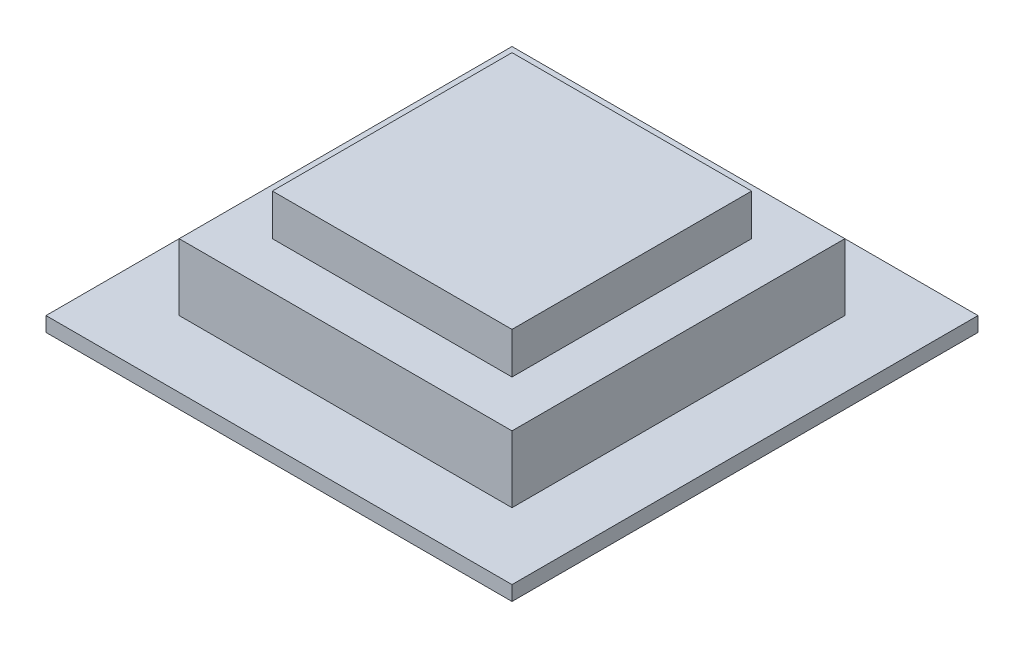
ISO-10303-21;
HEADER;
FILE_DESCRIPTION(('STEP AP214'),'2;1');
FILE_NAME('part.step','',(''),(''),'','','');
FILE_SCHEMA(('AUTOMOTIVE_DESIGN { 1 0 10303 214 1 1 1 1 }'));
ENDSEC;
DATA;
#1=APPLICATION_CONTEXT('core data for automotive mechanical design processes');
#2=APPLICATION_PROTOCOL_DEFINITION('international standard','automotive_design',2000,#1);
#3=PRODUCT_CONTEXT('',#1,'mechanical');
#4=PRODUCT('Part','Part','',(#3));
#5=PRODUCT_RELATED_PRODUCT_CATEGORY('part','',(#4));
#6=PRODUCT_DEFINITION_FORMATION('','',#4);
#7=PRODUCT_DEFINITION_CONTEXT('part definition',#1,'design');
#8=PRODUCT_DEFINITION('design','',#6,#7);
#9=PRODUCT_DEFINITION_SHAPE('','',#8);
#10=(LENGTH_UNIT() NAMED_UNIT(*) SI_UNIT(.MILLI.,.METRE.));
#11=(NAMED_UNIT(*) PLANE_ANGLE_UNIT() SI_UNIT($,.RADIAN.));
#12=(NAMED_UNIT(*) SI_UNIT($,.STERADIAN.) SOLID_ANGLE_UNIT());
#13=UNCERTAINTY_MEASURE_WITH_UNIT(LENGTH_MEASURE(1.E-05),#10,'distance_accuracy_value','');
#14=(GEOMETRIC_REPRESENTATION_CONTEXT(3) GLOBAL_UNCERTAINTY_ASSIGNED_CONTEXT((#13)) GLOBAL_UNIT_ASSIGNED_CONTEXT((#10,
#11,#12)) REPRESENTATION_CONTEXT('',''));
#15=CARTESIAN_POINT('',(0.,0.,0.));
#16=DIRECTION('',(0.,0.,1.));
#17=DIRECTION('',(1.,0.,0.));
#18=AXIS2_PLACEMENT_3D('',#15,#16,#17);
#19=CARTESIAN_POINT('',(0.,6.1,0.));
#20=DIRECTION('',(0.,-1.,0.));
#21=DIRECTION('',(0.,0.,-1.));
#22=AXIS2_PLACEMENT_3D('',#19,#20,#21);
#23=PLANE('',#22);
#24=DIRECTION('',(0.,0.,-1.));
#25=VECTOR('',#24,1.);
#26=CARTESIAN_POINT('',(12.5,6.1,12.5));
#27=LINE('',#26,#25);
#28=CARTESIAN_POINT('',(12.5,6.1,12.5));
#29=VERTEX_POINT('',#28);
#30=CARTESIAN_POINT('',(12.5,6.1,-12.5));
#31=VERTEX_POINT('',#30);
#32=EDGE_CURVE('E164',#29,#31,#27,.T.);
#33=ORIENTED_EDGE('',*,*,#32,.T.);
#34=DIRECTION('',(-1.,0.,0.));
#35=VECTOR('',#34,1.);
#36=CARTESIAN_POINT('',(-12.5,6.1,-12.5));
#37=LINE('',#36,#35);
#38=CARTESIAN_POINT('',(-12.5,6.1,-12.5));
#39=VERTEX_POINT('',#38);
#40=EDGE_CURVE('E168',#31,#39,#37,.T.);
#41=ORIENTED_EDGE('',*,*,#40,.T.);
#42=DIRECTION('',(0.,0.,1.));
#43=VECTOR('',#42,1.);
#44=CARTESIAN_POINT('',(-12.5,6.1,12.5));
#45=LINE('',#44,#43);
#46=CARTESIAN_POINT('',(-12.5,6.1,12.5));
#47=VERTEX_POINT('',#46);
#48=EDGE_CURVE('E172',#39,#47,#45,.T.);
#49=ORIENTED_EDGE('',*,*,#48,.T.);
#50=DIRECTION('',(1.,0.,0.));
#51=VECTOR('',#50,1.);
#52=CARTESIAN_POINT('',(-12.5,6.1,12.5));
#53=LINE('',#52,#51);
#54=EDGE_CURVE('E175',#47,#29,#53,.T.);
#55=ORIENTED_EDGE('',*,*,#54,.T.);
#56=EDGE_LOOP('',(#33,#41,#49,#55));
#57=FACE_BOUND('',#56,.T.);
#58=DIRECTION('',(1.,0.,0.));
#59=VECTOR('',#58,1.);
#60=CARTESIAN_POINT('',(0.,6.1,9.));
#61=LINE('',#60,#59);
#62=CARTESIAN_POINT('',(-9.,6.1,9.));
#63=VERTEX_POINT('',#62);
#64=CARTESIAN_POINT('',(9.,6.1,9.));
#65=VERTEX_POINT('',#64);
#66=EDGE_CURVE('E55',#63,#65,#61,.T.);
#67=ORIENTED_EDGE('',*,*,#66,.F.);
#68=DIRECTION('',(0.,0.,-1.));
#69=VECTOR('',#68,1.);
#70=CARTESIAN_POINT('',(-9.,6.1,0.));
#71=LINE('',#70,#69);
#72=CARTESIAN_POINT('',(-9.,6.1,-9.));
#73=VERTEX_POINT('',#72);
#74=EDGE_CURVE('E60',#63,#73,#71,.T.);
#75=ORIENTED_EDGE('',*,*,#74,.T.);
#76=DIRECTION('',(1.,0.,0.));
#77=VECTOR('',#76,1.);
#78=CARTESIAN_POINT('',(0.,6.1,-9.));
#79=LINE('',#78,#77);
#80=CARTESIAN_POINT('',(9.,6.1,-9.));
#81=VERTEX_POINT('',#80);
#82=EDGE_CURVE('E403',#73,#81,#79,.T.);
#83=ORIENTED_EDGE('',*,*,#82,.T.);
#84=DIRECTION('',(0.,0.,-1.));
#85=VECTOR('',#84,1.);
#86=CARTESIAN_POINT('',(9.,6.1,0.));
#87=LINE('',#86,#85);
#88=EDGE_CURVE('E406',#65,#81,#87,.T.);
#89=ORIENTED_EDGE('',*,*,#88,.F.);
#90=EDGE_LOOP('',(#67,#75,#83,#89));
#91=FACE_BOUND('',#90,.T.);
#92=ADVANCED_FACE('F39',(#57,#91),#23,.F.);
#93=CARTESIAN_POINT('',(0.,1.1,0.));
#94=DIRECTION('',(0.,-1.,0.));
#95=DIRECTION('',(0.,0.,-1.));
#96=AXIS2_PLACEMENT_3D('',#93,#94,#95);
#97=PLANE('',#96);
#98=DIRECTION('',(0.,0.,-1.));
#99=VECTOR('',#98,1.);
#100=CARTESIAN_POINT('',(17.5,1.1,17.4999999999999));
#101=LINE('',#100,#99);
#102=CARTESIAN_POINT('',(17.5,1.1,17.4999999999999));
#103=VERTEX_POINT('',#102);
#104=CARTESIAN_POINT('',(17.5,1.1,-17.5));
#105=VERTEX_POINT('',#104);
#106=EDGE_CURVE('E205',#103,#105,#101,.T.);
#107=ORIENTED_EDGE('',*,*,#106,.T.);
#108=DIRECTION('',(-1.,0.,0.));
#109=VECTOR('',#108,1.);
#110=CARTESIAN_POINT('',(-17.4999999999999,1.1,-17.5));
#111=LINE('',#110,#109);
#112=CARTESIAN_POINT('',(-17.4999999999999,1.1,-17.5));
#113=VERTEX_POINT('',#112);
#114=EDGE_CURVE('E209',#105,#113,#111,.T.);
#115=ORIENTED_EDGE('',*,*,#114,.T.);
#116=DIRECTION('',(0.,0.,1.));
#117=VECTOR('',#116,1.);
#118=CARTESIAN_POINT('',(-17.4999999999999,1.1,17.4999999999999));
#119=LINE('',#118,#117);
#120=CARTESIAN_POINT('',(-17.4999999999999,1.1,17.4999999999999));
#121=VERTEX_POINT('',#120);
#122=EDGE_CURVE('E213',#113,#121,#119,.T.);
#123=ORIENTED_EDGE('',*,*,#122,.T.);
#124=DIRECTION('',(1.,0.,0.));
#125=VECTOR('',#124,1.);
#126=CARTESIAN_POINT('',(-17.4999999999999,1.1,17.4999999999999));
#127=LINE('',#126,#125);
#128=EDGE_CURVE('E216',#121,#103,#127,.T.);
#129=ORIENTED_EDGE('',*,*,#128,.T.);
#130=EDGE_LOOP('',(#107,#115,#123,#129));
#131=FACE_BOUND('',#130,.T.);
#132=DIRECTION('',(0.,0.,-1.));
#133=VECTOR('',#132,1.);
#134=CARTESIAN_POINT('',(12.5,1.1,12.5));
#135=LINE('',#134,#133);
#136=CARTESIAN_POINT('',(12.5,1.1,12.5));
#137=VERTEX_POINT('',#136);
#138=CARTESIAN_POINT('',(12.5,1.1,-12.5));
#139=VERTEX_POINT('',#138);
#140=EDGE_CURVE('E153',#137,#139,#135,.T.);
#141=ORIENTED_EDGE('',*,*,#140,.F.);
#142=DIRECTION('',(1.,0.,0.));
#143=VECTOR('',#142,1.);
#144=CARTESIAN_POINT('',(-12.5,1.1,12.5));
#145=LINE('',#144,#143);
#146=CARTESIAN_POINT('',(-12.5,1.1,12.5));
#147=VERTEX_POINT('',#146);
#148=EDGE_CURVE('E169',#147,#137,#145,.T.);
#149=ORIENTED_EDGE('',*,*,#148,.F.);
#150=DIRECTION('',(0.,0.,1.));
#151=VECTOR('',#150,1.);
#152=CARTESIAN_POINT('',(-12.5,1.1,12.5));
#153=LINE('',#152,#151);
#154=CARTESIAN_POINT('',(-12.5,1.1,-12.5));
#155=VERTEX_POINT('',#154);
#156=EDGE_CURVE('E182',#155,#147,#153,.T.);
#157=ORIENTED_EDGE('',*,*,#156,.F.);
#158=DIRECTION('',(-1.,0.,0.));
#159=VECTOR('',#158,1.);
#160=CARTESIAN_POINT('',(-12.5,1.1,-12.5));
#161=LINE('',#160,#159);
#162=EDGE_CURVE('E158',#139,#155,#161,.T.);
#163=ORIENTED_EDGE('',*,*,#162,.F.);
#164=EDGE_LOOP('',(#141,#149,#157,#163));
#165=FACE_BOUND('',#164,.T.);
#166=ADVANCED_FACE('F258',(#131,#165),#97,.F.);
#167=CARTESIAN_POINT('',(17.5,1.1,17.4999999999999));
#168=DIRECTION('',(-1.,0.,0.));
#169=DIRECTION('',(0.,0.,1.));
#170=AXIS2_PLACEMENT_3D('',#167,#168,#169);
#171=PLANE('',#170);
#172=DIRECTION('',(0.,0.,-1.));
#173=VECTOR('',#172,1.);
#174=CARTESIAN_POINT('',(17.5,0.,17.4999999999999));
#175=LINE('',#174,#173);
#176=CARTESIAN_POINT('',(17.5,0.,17.4999999999999));
#177=VERTEX_POINT('',#176);
#178=CARTESIAN_POINT('',(17.5,0.,-17.5));
#179=VERTEX_POINT('',#178);
#180=EDGE_CURVE('E204',#177,#179,#175,.T.);
#181=ORIENTED_EDGE('',*,*,#180,.T.);
#182=DIRECTION('',(0.,-1.,0.));
#183=VECTOR('',#182,1.);
#184=CARTESIAN_POINT('',(17.5,1.1,-17.5));
#185=LINE('',#184,#183);
#186=EDGE_CURVE('E11',#105,#179,#185,.T.);
#187=ORIENTED_EDGE('',*,*,#186,.F.);
#188=ORIENTED_EDGE('',*,*,#106,.F.);
#189=DIRECTION('',(0.,-1.,0.));
#190=VECTOR('',#189,1.);
#191=CARTESIAN_POINT('',(17.5,1.1,17.4999999999999));
#192=LINE('',#191,#190);
#193=EDGE_CURVE('E219',#103,#177,#192,.T.);
#194=ORIENTED_EDGE('',*,*,#193,.T.);
#195=EDGE_LOOP('',(#181,#187,#188,#194));
#196=FACE_BOUND('',#195,.T.);
#197=ADVANCED_FACE('F41',(#196),#171,.F.);
#198=CARTESIAN_POINT('',(-17.4999999999999,1.1,-17.5));
#199=DIRECTION('',(0.,0.,1.));
#200=DIRECTION('',(1.,0.,0.));
#201=AXIS2_PLACEMENT_3D('',#198,#199,#200);
#202=PLANE('',#201);
#203=DIRECTION('',(-1.,0.,0.));
#204=VECTOR('',#203,1.);
#205=CARTESIAN_POINT('',(-17.4999999999999,0.,-17.5));
#206=LINE('',#205,#204);
#207=CARTESIAN_POINT('',(-17.4999999999999,0.,-17.5));
#208=VERTEX_POINT('',#207);
#209=EDGE_CURVE('E223',#179,#208,#206,.T.);
#210=ORIENTED_EDGE('',*,*,#209,.T.);
#211=DIRECTION('',(0.,-1.,0.));
#212=VECTOR('',#211,1.);
#213=CARTESIAN_POINT('',(-17.4999999999999,1.1,-17.5));
#214=LINE('',#213,#212);
#215=EDGE_CURVE('E48',#113,#208,#214,.T.);
#216=ORIENTED_EDGE('',*,*,#215,.F.);
#217=ORIENTED_EDGE('',*,*,#114,.F.);
#218=ORIENTED_EDGE('',*,*,#186,.T.);
#219=EDGE_LOOP('',(#210,#216,#217,#218));
#220=FACE_BOUND('',#219,.T.);
#221=ADVANCED_FACE('F260',(#220),#202,.F.);
#222=CARTESIAN_POINT('',(-17.4999999999999,1.1,17.4999999999999));
#223=DIRECTION('',(1.,0.,0.));
#224=DIRECTION('',(0.,0.,-1.));
#225=AXIS2_PLACEMENT_3D('',#222,#223,#224);
#226=PLANE('',#225);
#227=DIRECTION('',(0.,0.,1.));
#228=VECTOR('',#227,1.);
#229=CARTESIAN_POINT('',(-17.4999999999999,0.,17.4999999999999));
#230=LINE('',#229,#228);
#231=CARTESIAN_POINT('',(-17.4999999999999,0.,17.4999999999999));
#232=VERTEX_POINT('',#231);
#233=EDGE_CURVE('E226',#208,#232,#230,.T.);
#234=ORIENTED_EDGE('',*,*,#233,.T.);
#235=DIRECTION('',(0.,-1.,0.));
#236=VECTOR('',#235,1.);
#237=CARTESIAN_POINT('',(-17.4999999999999,1.1,17.4999999999999));
#238=LINE('',#237,#236);
#239=EDGE_CURVE('E234',#121,#232,#238,.T.);
#240=ORIENTED_EDGE('',*,*,#239,.F.);
#241=ORIENTED_EDGE('',*,*,#122,.F.);
#242=ORIENTED_EDGE('',*,*,#215,.T.);
#243=EDGE_LOOP('',(#234,#240,#241,#242));
#244=FACE_BOUND('',#243,.T.);
#245=ADVANCED_FACE('F243',(#244),#226,.F.);
#246=CARTESIAN_POINT('',(-17.4999999999999,1.1,17.4999999999999));
#247=DIRECTION('',(0.,0.,-1.));
#248=DIRECTION('',(-1.,0.,0.));
#249=AXIS2_PLACEMENT_3D('',#246,#247,#248);
#250=PLANE('',#249);
#251=DIRECTION('',(1.,0.,0.));
#252=VECTOR('',#251,1.);
#253=CARTESIAN_POINT('',(-17.4999999999999,0.,17.4999999999999));
#254=LINE('',#253,#252);
#255=EDGE_CURVE('E210',#232,#177,#254,.T.);
#256=ORIENTED_EDGE('',*,*,#255,.T.);
#257=ORIENTED_EDGE('',*,*,#193,.F.);
#258=ORIENTED_EDGE('',*,*,#128,.F.);
#259=ORIENTED_EDGE('',*,*,#239,.T.);
#260=EDGE_LOOP('',(#256,#257,#258,#259));
#261=FACE_BOUND('',#260,.T.);
#262=ADVANCED_FACE('F252',(#261),#250,.F.);
#263=CARTESIAN_POINT('',(0.,0.,0.));
#264=DIRECTION('',(0.,-1.,0.));
#265=DIRECTION('',(0.,0.,-1.));
#266=AXIS2_PLACEMENT_3D('',#263,#264,#265);
#267=PLANE('',#266);
#268=ORIENTED_EDGE('',*,*,#180,.F.);
#269=ORIENTED_EDGE('',*,*,#255,.F.);
#270=ORIENTED_EDGE('',*,*,#233,.F.);
#271=ORIENTED_EDGE('',*,*,#209,.F.);
#272=EDGE_LOOP('',(#268,#269,#270,#271));
#273=FACE_BOUND('',#272,.T.);
#274=ADVANCED_FACE('F249',(#273),#267,.T.);
#275=CARTESIAN_POINT('',(12.5,6.1,12.5));
#276=DIRECTION('',(-1.,0.,0.));
#277=DIRECTION('',(0.,0.,1.));
#278=AXIS2_PLACEMENT_3D('',#275,#276,#277);
#279=PLANE('',#278);
#280=ORIENTED_EDGE('',*,*,#140,.T.);
#281=DIRECTION('',(0.,-1.,0.));
#282=VECTOR('',#281,1.);
#283=CARTESIAN_POINT('',(12.5,6.1,-12.5));
#284=LINE('',#283,#282);
#285=EDGE_CURVE('E200',#31,#139,#284,.T.);
#286=ORIENTED_EDGE('',*,*,#285,.F.);
#287=ORIENTED_EDGE('',*,*,#32,.F.);
#288=DIRECTION('',(0.,-1.,0.));
#289=VECTOR('',#288,1.);
#290=CARTESIAN_POINT('',(12.5,6.1,12.5));
#291=LINE('',#290,#289);
#292=EDGE_CURVE('E177',#29,#137,#291,.T.);
#293=ORIENTED_EDGE('',*,*,#292,.T.);
#294=EDGE_LOOP('',(#280,#286,#287,#293));
#295=FACE_BOUND('',#294,.T.);
#296=ADVANCED_FACE('F288',(#295),#279,.F.);
#297=CARTESIAN_POINT('',(-12.5,6.1,-12.5));
#298=DIRECTION('',(0.,0.,1.));
#299=DIRECTION('',(1.,0.,0.));
#300=AXIS2_PLACEMENT_3D('',#297,#298,#299);
#301=PLANE('',#300);
#302=ORIENTED_EDGE('',*,*,#162,.T.);
#303=DIRECTION('',(0.,-1.,0.));
#304=VECTOR('',#303,1.);
#305=CARTESIAN_POINT('',(-12.5,6.1,-12.5));
#306=LINE('',#305,#304);
#307=EDGE_CURVE('E196',#39,#155,#306,.T.);
#308=ORIENTED_EDGE('',*,*,#307,.F.);
#309=ORIENTED_EDGE('',*,*,#40,.F.);
#310=ORIENTED_EDGE('',*,*,#285,.T.);
#311=EDGE_LOOP('',(#302,#308,#309,#310));
#312=FACE_BOUND('',#311,.T.);
#313=ADVANCED_FACE('F284',(#312),#301,.F.);
#314=CARTESIAN_POINT('',(-12.5,6.1,12.5));
#315=DIRECTION('',(1.,0.,0.));
#316=DIRECTION('',(0.,0.,-1.));
#317=AXIS2_PLACEMENT_3D('',#314,#315,#316);
#318=PLANE('',#317);
#319=ORIENTED_EDGE('',*,*,#156,.T.);
#320=DIRECTION('',(0.,-1.,0.));
#321=VECTOR('',#320,1.);
#322=CARTESIAN_POINT('',(-12.5,6.1,12.5));
#323=LINE('',#322,#321);
#324=EDGE_CURVE('E192',#47,#147,#323,.T.);
#325=ORIENTED_EDGE('',*,*,#324,.F.);
#326=ORIENTED_EDGE('',*,*,#48,.F.);
#327=ORIENTED_EDGE('',*,*,#307,.T.);
#328=EDGE_LOOP('',(#319,#325,#326,#327));
#329=FACE_BOUND('',#328,.T.);
#330=ADVANCED_FACE('F280',(#329),#318,.F.);
#331=CARTESIAN_POINT('',(-12.5,6.1,12.5));
#332=DIRECTION('',(0.,0.,-1.));
#333=DIRECTION('',(-1.,0.,0.));
#334=AXIS2_PLACEMENT_3D('',#331,#332,#333);
#335=PLANE('',#334);
#336=ORIENTED_EDGE('',*,*,#148,.T.);
#337=ORIENTED_EDGE('',*,*,#292,.F.);
#338=ORIENTED_EDGE('',*,*,#54,.F.);
#339=ORIENTED_EDGE('',*,*,#324,.T.);
#340=EDGE_LOOP('',(#336,#337,#338,#339));
#341=FACE_BOUND('',#340,.T.);
#342=ADVANCED_FACE('F277',(#341),#335,.F.);
#343=CARTESIAN_POINT('',(0.,9.2,9.));
#344=DIRECTION('',(0.,0.,-1.));
#345=DIRECTION('',(-1.,0.,0.));
#346=AXIS2_PLACEMENT_3D('',#343,#344,#345);
#347=PLANE('',#346);
#348=ORIENTED_EDGE('',*,*,#66,.T.);
#349=DIRECTION('',(0.,-1.,0.));
#350=VECTOR('',#349,1.);
#351=CARTESIAN_POINT('',(9.,9.2,9.));
#352=LINE('',#351,#350);
#353=CARTESIAN_POINT('',(9.,9.2,9.));
#354=VERTEX_POINT('',#353);
#355=EDGE_CURVE('E133',#354,#65,#352,.T.);
#356=ORIENTED_EDGE('',*,*,#355,.F.);
#357=DIRECTION('',(1.,0.,0.));
#358=VECTOR('',#357,1.);
#359=CARTESIAN_POINT('',(0.,9.2,9.));
#360=LINE('',#359,#358);
#361=CARTESIAN_POINT('',(-9.,9.2,9.));
#362=VERTEX_POINT('',#361);
#363=EDGE_CURVE('E141',#362,#354,#360,.T.);
#364=ORIENTED_EDGE('',*,*,#363,.F.);
#365=DIRECTION('',(0.,-1.,0.));
#366=VECTOR('',#365,1.);
#367=CARTESIAN_POINT('',(-9.,9.2,9.));
#368=LINE('',#367,#366);
#369=EDGE_CURVE('E400',#362,#63,#368,.T.);
#370=ORIENTED_EDGE('',*,*,#369,.T.);
#371=EDGE_LOOP('',(#348,#356,#364,#370));
#372=FACE_BOUND('',#371,.T.);
#373=ADVANCED_FACE('F151',(#372),#347,.F.);
#374=CARTESIAN_POINT('',(9.,9.2,0.));
#375=DIRECTION('',(-1.,0.,0.));
#376=DIRECTION('',(0.,0.,1.));
#377=AXIS2_PLACEMENT_3D('',#374,#375,#376);
#378=PLANE('',#377);
#379=ORIENTED_EDGE('',*,*,#88,.T.);
#380=DIRECTION('',(0.,-1.,0.));
#381=VECTOR('',#380,1.);
#382=CARTESIAN_POINT('',(9.,9.2,-9.));
#383=LINE('',#382,#381);
#384=CARTESIAN_POINT('',(9.,9.2,-9.));
#385=VERTEX_POINT('',#384);
#386=EDGE_CURVE('E135',#385,#81,#383,.T.);
#387=ORIENTED_EDGE('',*,*,#386,.F.);
#388=DIRECTION('',(0.,0.,-1.));
#389=VECTOR('',#388,1.);
#390=CARTESIAN_POINT('',(9.,9.2,0.));
#391=LINE('',#390,#389);
#392=EDGE_CURVE('E128',#354,#385,#391,.T.);
#393=ORIENTED_EDGE('',*,*,#392,.F.);
#394=ORIENTED_EDGE('',*,*,#355,.T.);
#395=EDGE_LOOP('',(#379,#387,#393,#394));
#396=FACE_BOUND('',#395,.T.);
#397=ADVANCED_FACE('F131',(#396),#378,.F.);
#398=CARTESIAN_POINT('',(0.,9.2,-9.));
#399=DIRECTION('',(0.,0.,-1.));
#400=DIRECTION('',(-1.,0.,0.));
#401=AXIS2_PLACEMENT_3D('',#398,#399,#400);
#402=PLANE('',#401);
#403=ORIENTED_EDGE('',*,*,#82,.F.);
#404=DIRECTION('',(0.,-1.,0.));
#405=VECTOR('',#404,1.);
#406=CARTESIAN_POINT('',(-9.,9.2,-9.));
#407=LINE('',#406,#405);
#408=CARTESIAN_POINT('',(-9.,9.2,-9.));
#409=VERTEX_POINT('',#408);
#410=EDGE_CURVE('E160',#409,#73,#407,.T.);
#411=ORIENTED_EDGE('',*,*,#410,.F.);
#412=DIRECTION('',(1.,0.,0.));
#413=VECTOR('',#412,1.);
#414=CARTESIAN_POINT('',(0.,9.2,-9.));
#415=LINE('',#414,#413);
#416=EDGE_CURVE('E140',#409,#385,#415,.T.);
#417=ORIENTED_EDGE('',*,*,#416,.T.);
#418=ORIENTED_EDGE('',*,*,#386,.T.);
#419=EDGE_LOOP('',(#403,#411,#417,#418));
#420=FACE_BOUND('',#419,.T.);
#421=ADVANCED_FACE('F332',(#420),#402,.T.);
#422=CARTESIAN_POINT('',(-9.,9.2,0.));
#423=DIRECTION('',(-1.,0.,0.));
#424=DIRECTION('',(0.,0.,1.));
#425=AXIS2_PLACEMENT_3D('',#422,#423,#424);
#426=PLANE('',#425);
#427=ORIENTED_EDGE('',*,*,#74,.F.);
#428=ORIENTED_EDGE('',*,*,#369,.F.);
#429=DIRECTION('',(0.,0.,-1.));
#430=VECTOR('',#429,1.);
#431=CARTESIAN_POINT('',(-9.,9.2,0.));
#432=LINE('',#431,#430);
#433=EDGE_CURVE('E147',#362,#409,#432,.T.);
#434=ORIENTED_EDGE('',*,*,#433,.T.);
#435=ORIENTED_EDGE('',*,*,#410,.T.);
#436=EDGE_LOOP('',(#427,#428,#434,#435));
#437=FACE_BOUND('',#436,.T.);
#438=ADVANCED_FACE('F338',(#437),#426,.T.);
#439=CARTESIAN_POINT('',(0.,9.2,0.));
#440=DIRECTION('',(0.,1.,0.));
#441=DIRECTION('',(0.,0.,1.));
#442=AXIS2_PLACEMENT_3D('',#439,#440,#441);
#443=PLANE('',#442);
#444=ORIENTED_EDGE('',*,*,#363,.T.);
#445=ORIENTED_EDGE('',*,*,#392,.T.);
#446=ORIENTED_EDGE('',*,*,#416,.F.);
#447=ORIENTED_EDGE('',*,*,#433,.F.);
#448=EDGE_LOOP('',(#444,#445,#446,#447));
#449=FACE_BOUND('',#448,.T.);
#450=ADVANCED_FACE('F145',(#449),#443,.T.);
#451=CLOSED_SHELL('',(#92,#166,#197,#221,#245,#262,#274,#296,#313,#330,#342,#373,#397,#421,#438,#450));
#452=MANIFOLD_SOLID_BREP('B2',#451);
#453=ADVANCED_BREP_SHAPE_REPRESENTATION('',(#18,#452),#14);
#454=SHAPE_DEFINITION_REPRESENTATION(#9,#453);
ENDSEC;
END-ISO-10303-21;
